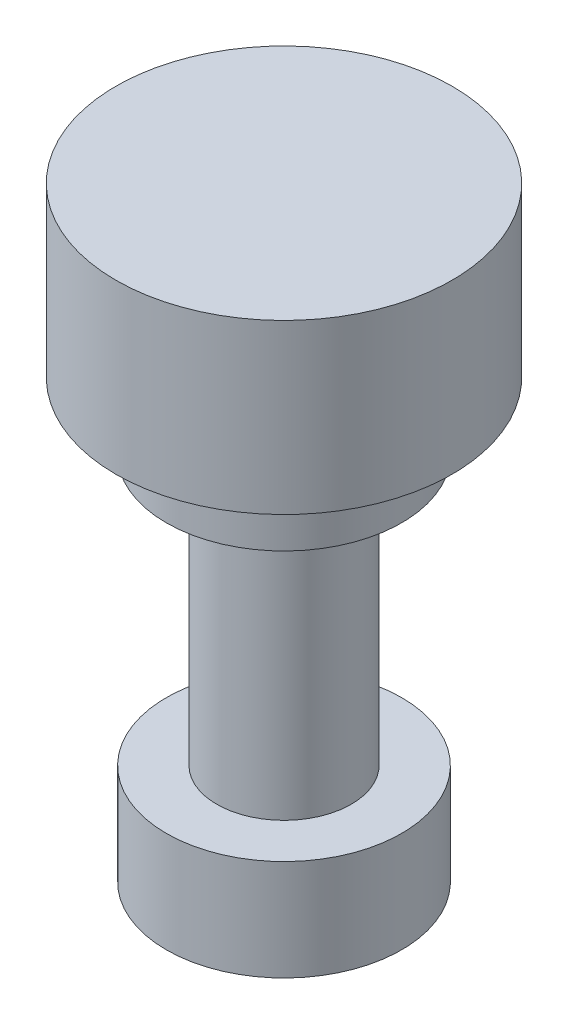
ISO-10303-21;
HEADER;
FILE_DESCRIPTION(('STEP AP214'),'2;1');
FILE_NAME('part.step','',(''),(''),'','','');
FILE_SCHEMA(('AUTOMOTIVE_DESIGN { 1 0 10303 214 1 1 1 1 }'));
ENDSEC;
DATA;
#1=APPLICATION_CONTEXT('core data for automotive mechanical design processes');
#2=APPLICATION_PROTOCOL_DEFINITION('international standard','automotive_design',2000,#1);
#3=PRODUCT_CONTEXT('',#1,'mechanical');
#4=PRODUCT('Part','Part','',(#3));
#5=PRODUCT_RELATED_PRODUCT_CATEGORY('part','',(#4));
#6=PRODUCT_DEFINITION_FORMATION('','',#4);
#7=PRODUCT_DEFINITION_CONTEXT('part definition',#1,'design');
#8=PRODUCT_DEFINITION('design','',#6,#7);
#9=PRODUCT_DEFINITION_SHAPE('','',#8);
#10=(LENGTH_UNIT() NAMED_UNIT(*) SI_UNIT(.MILLI.,.METRE.));
#11=(NAMED_UNIT(*) PLANE_ANGLE_UNIT() SI_UNIT($,.RADIAN.));
#12=(NAMED_UNIT(*) SI_UNIT($,.STERADIAN.) SOLID_ANGLE_UNIT());
#13=UNCERTAINTY_MEASURE_WITH_UNIT(LENGTH_MEASURE(1.E-05),#10,'distance_accuracy_value','');
#14=(GEOMETRIC_REPRESENTATION_CONTEXT(3) GLOBAL_UNCERTAINTY_ASSIGNED_CONTEXT((#13)) GLOBAL_UNIT_ASSIGNED_CONTEXT((#10,
#11,#12)) REPRESENTATION_CONTEXT('',''));
#15=CARTESIAN_POINT('',(0.,0.,0.));
#16=DIRECTION('',(0.,0.,1.));
#17=DIRECTION('',(1.,0.,0.));
#18=AXIS2_PLACEMENT_3D('',#15,#16,#17);
#19=CARTESIAN_POINT('',(0.,125.,0.));
#20=DIRECTION('',(0.,-1.,0.));
#21=DIRECTION('',(0.,0.,-1.));
#22=AXIS2_PLACEMENT_3D('',#19,#20,#21);
#23=CYLINDRICAL_SURFACE('',#22,250.);
#24=CARTESIAN_POINT('',(0.,125.,0.));
#25=DIRECTION('',(0.,1.,0.));
#26=DIRECTION('',(0.,0.,1.));
#27=AXIS2_PLACEMENT_3D('',#24,#25,#26);
#28=CIRCLE('',#27,250.);
#29=CARTESIAN_POINT('',(0.,125.,250.));
#30=VERTEX_POINT('',#29);
#31=EDGE_CURVE('E57',#30,#30,#28,.T.);
#32=ORIENTED_EDGE('',*,*,#31,.F.);
#33=EDGE_LOOP('',(#32));
#34=FACE_BOUND('',#33,.T.);
#35=CARTESIAN_POINT('',(0.,-125.,0.));
#36=DIRECTION('',(0.,1.,0.));
#37=DIRECTION('',(0.,0.,1.));
#38=AXIS2_PLACEMENT_3D('',#35,#36,#37);
#39=CIRCLE('',#38,250.);
#40=CARTESIAN_POINT('',(0.,-125.,250.));
#41=VERTEX_POINT('',#40);
#42=EDGE_CURVE('E46',#41,#41,#39,.T.);
#43=ORIENTED_EDGE('',*,*,#42,.T.);
#44=EDGE_LOOP('',(#43));
#45=FACE_BOUND('',#44,.T.);
#46=ADVANCED_FACE('F43',(#34,#45),#23,.T.);
#47=CARTESIAN_POINT('',(0.,125.,0.));
#48=DIRECTION('',(0.,1.,0.));
#49=DIRECTION('',(0.,0.,1.));
#50=AXIS2_PLACEMENT_3D('',#47,#48,#49);
#51=PLANE('',#50);
#52=ORIENTED_EDGE('',*,*,#31,.T.);
#53=EDGE_LOOP('',(#52));
#54=FACE_BOUND('',#53,.T.);
#55=ADVANCED_FACE('F78',(#54),#51,.T.);
#56=CARTESIAN_POINT('',(0.,-125.,0.));
#57=DIRECTION('',(0.,1.,0.));
#58=DIRECTION('',(0.,0.,1.));
#59=AXIS2_PLACEMENT_3D('',#56,#57,#58);
#60=PLANE('',#59);
#61=CARTESIAN_POINT('',(0.,-125.,0.));
#62=DIRECTION('',(0.,-1.,0.));
#63=DIRECTION('',(0.,0.,-1.));
#64=AXIS2_PLACEMENT_3D('',#61,#62,#63);
#65=CIRCLE('',#64,175.);
#66=CARTESIAN_POINT('',(0.,-125.,-175.));
#67=VERTEX_POINT('',#66);
#68=EDGE_CURVE('E51',#67,#67,#65,.T.);
#69=ORIENTED_EDGE('',*,*,#68,.F.);
#70=EDGE_LOOP('',(#69));
#71=FACE_BOUND('',#70,.T.);
#72=ORIENTED_EDGE('',*,*,#42,.F.);
#73=EDGE_LOOP('',(#72));
#74=FACE_BOUND('',#73,.T.);
#75=ADVANCED_FACE('F75',(#71,#74),#60,.F.);
#76=CARTESIAN_POINT('',(0.,-225.,0.));
#77=DIRECTION('',(0.,1.,0.));
#78=DIRECTION('',(0.,0.,1.));
#79=AXIS2_PLACEMENT_3D('',#76,#77,#78);
#80=CYLINDRICAL_SURFACE('',#79,175.);
#81=CARTESIAN_POINT('',(0.,-225.,0.));
#82=DIRECTION('',(0.,-1.,0.));
#83=DIRECTION('',(0.,0.,-1.));
#84=AXIS2_PLACEMENT_3D('',#81,#82,#83);
#85=CIRCLE('',#84,175.);
#86=CARTESIAN_POINT('',(0.,-225.,-175.));
#87=VERTEX_POINT('',#86);
#88=EDGE_CURVE('E63',#87,#87,#85,.T.);
#89=ORIENTED_EDGE('',*,*,#88,.F.);
#90=EDGE_LOOP('',(#89));
#91=FACE_BOUND('',#90,.T.);
#92=ORIENTED_EDGE('',*,*,#68,.T.);
#93=EDGE_LOOP('',(#92));
#94=FACE_BOUND('',#93,.T.);
#95=ADVANCED_FACE('F77',(#91,#94),#80,.T.);
#96=CARTESIAN_POINT('',(0.,-225.,0.));
#97=DIRECTION('',(0.,-1.,0.));
#98=DIRECTION('',(0.,0.,-1.));
#99=AXIS2_PLACEMENT_3D('',#96,#97,#98);
#100=PLANE('',#99);
#101=CARTESIAN_POINT('',(0.,-225.,0.));
#102=DIRECTION('',(0.,-1.,0.));
#103=DIRECTION('',(0.,0.,-1.));
#104=AXIS2_PLACEMENT_3D('',#101,#102,#103);
#105=CIRCLE('',#104,100.);
#106=CARTESIAN_POINT('',(0.,-225.,-100.));
#107=VERTEX_POINT('',#106);
#108=EDGE_CURVE('E10',#107,#107,#105,.T.);
#109=ORIENTED_EDGE('',*,*,#108,.F.);
#110=EDGE_LOOP('',(#109));
#111=FACE_BOUND('',#110,.T.);
#112=ORIENTED_EDGE('',*,*,#88,.T.);
#113=EDGE_LOOP('',(#112));
#114=FACE_BOUND('',#113,.T.);
#115=ADVANCED_FACE('F84',(#111,#114),#100,.T.);
#116=CARTESIAN_POINT('',(0.,-625.,0.));
#117=DIRECTION('',(0.,1.,0.));
#118=DIRECTION('',(0.,0.,1.));
#119=AXIS2_PLACEMENT_3D('',#116,#117,#118);
#120=CYLINDRICAL_SURFACE('',#119,100.);
#121=CARTESIAN_POINT('',(0.,-625.,0.));
#122=DIRECTION('',(0.,-1.,0.));
#123=DIRECTION('',(0.,0.,-1.));
#124=AXIS2_PLACEMENT_3D('',#121,#122,#123);
#125=CIRCLE('',#124,100.);
#126=CARTESIAN_POINT('',(0.,-625.,-100.));
#127=VERTEX_POINT('',#126);
#128=EDGE_CURVE('E61',#127,#127,#125,.T.);
#129=ORIENTED_EDGE('',*,*,#128,.F.);
#130=EDGE_LOOP('',(#129));
#131=FACE_BOUND('',#130,.T.);
#132=ORIENTED_EDGE('',*,*,#108,.T.);
#133=EDGE_LOOP('',(#132));
#134=FACE_BOUND('',#133,.T.);
#135=ADVANCED_FACE('F118',(#131,#134),#120,.T.);
#136=CARTESIAN_POINT('',(0.,-775.,0.));
#137=DIRECTION('',(0.,1.,0.));
#138=DIRECTION('',(0.,0.,1.));
#139=AXIS2_PLACEMENT_3D('',#136,#137,#138);
#140=CYLINDRICAL_SURFACE('',#139,175.);
#141=CARTESIAN_POINT('',(0.,-775.,0.));
#142=DIRECTION('',(0.,-1.,0.));
#143=DIRECTION('',(0.,0.,-1.));
#144=AXIS2_PLACEMENT_3D('',#141,#142,#143);
#145=CIRCLE('',#144,175.);
#146=CARTESIAN_POINT('',(0.,-775.,-175.));
#147=VERTEX_POINT('',#146);
#148=EDGE_CURVE('E169',#147,#147,#145,.T.);
#149=ORIENTED_EDGE('',*,*,#148,.F.);
#150=EDGE_LOOP('',(#149));
#151=FACE_BOUND('',#150,.T.);
#152=CARTESIAN_POINT('',(0.,-625.,0.));
#153=DIRECTION('',(0.,-1.,0.));
#154=DIRECTION('',(0.,0.,-1.));
#155=AXIS2_PLACEMENT_3D('',#152,#153,#154);
#156=CIRCLE('',#155,175.);
#157=CARTESIAN_POINT('',(0.,-625.,-175.));
#158=VERTEX_POINT('',#157);
#159=EDGE_CURVE('E166',#158,#158,#156,.T.);
#160=ORIENTED_EDGE('',*,*,#159,.T.);
#161=EDGE_LOOP('',(#160));
#162=FACE_BOUND('',#161,.T.);
#163=ADVANCED_FACE('F128',(#151,#162),#140,.T.);
#164=CARTESIAN_POINT('',(0.,-775.,0.));
#165=DIRECTION('',(0.,-1.,0.));
#166=DIRECTION('',(0.,0.,-1.));
#167=AXIS2_PLACEMENT_3D('',#164,#165,#166);
#168=PLANE('',#167);
#169=ORIENTED_EDGE('',*,*,#148,.T.);
#170=EDGE_LOOP('',(#169));
#171=FACE_BOUND('',#170,.T.);
#172=ADVANCED_FACE('F138',(#171),#168,.T.);
#173=CARTESIAN_POINT('',(0.,-625.,0.));
#174=DIRECTION('',(0.,-1.,0.));
#175=DIRECTION('',(0.,0.,-1.));
#176=AXIS2_PLACEMENT_3D('',#173,#174,#175);
#177=PLANE('',#176);
#178=ORIENTED_EDGE('',*,*,#128,.T.);
#179=EDGE_LOOP('',(#178));
#180=FACE_BOUND('',#179,.T.);
#181=ORIENTED_EDGE('',*,*,#159,.F.);
#182=EDGE_LOOP('',(#181));
#183=FACE_BOUND('',#182,.T.);
#184=ADVANCED_FACE('F148',(#180,#183),#177,.F.);
#185=CLOSED_SHELL('',(#46,#55,#75,#95,#115,#135,#163,#172,#184));
#186=MANIFOLD_SOLID_BREP('B2',#185);
#187=ADVANCED_BREP_SHAPE_REPRESENTATION('',(#18,#186),#14);
#188=SHAPE_DEFINITION_REPRESENTATION(#9,#187);
ENDSEC;
END-ISO-10303-21;
